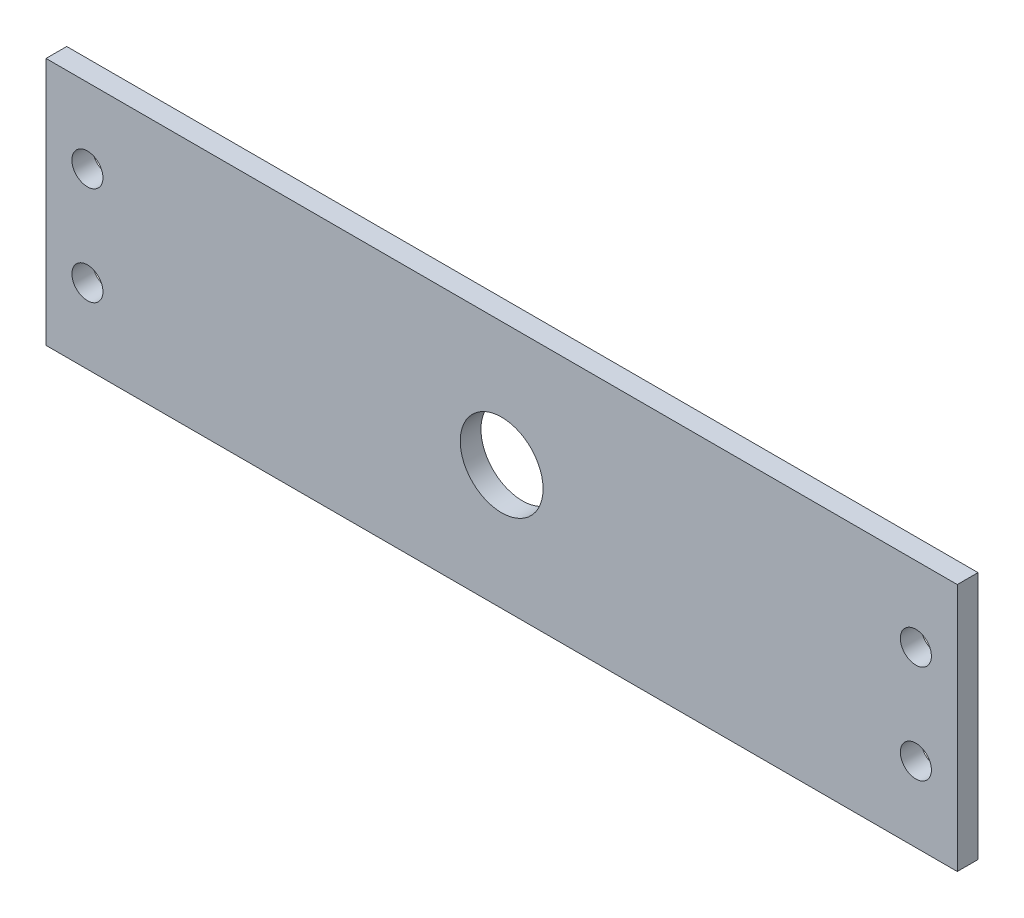
ISO-10303-21;
HEADER;
FILE_DESCRIPTION(('STEP AP214'),'2;1');
FILE_NAME('part.step','',(''),(''),'','','');
FILE_SCHEMA(('AUTOMOTIVE_DESIGN { 1 0 10303 214 1 1 1 1 }'));
ENDSEC;
DATA;
#1=APPLICATION_CONTEXT('core data for automotive mechanical design processes');
#2=APPLICATION_PROTOCOL_DEFINITION('international standard','automotive_design',2000,#1);
#3=PRODUCT_CONTEXT('',#1,'mechanical');
#4=PRODUCT('Part','Part','',(#3));
#5=PRODUCT_RELATED_PRODUCT_CATEGORY('part','',(#4));
#6=PRODUCT_DEFINITION_FORMATION('','',#4);
#7=PRODUCT_DEFINITION_CONTEXT('part definition',#1,'design');
#8=PRODUCT_DEFINITION('design','',#6,#7);
#9=PRODUCT_DEFINITION_SHAPE('','',#8);
#10=(LENGTH_UNIT() NAMED_UNIT(*) SI_UNIT(.MILLI.,.METRE.));
#11=(NAMED_UNIT(*) PLANE_ANGLE_UNIT() SI_UNIT($,.RADIAN.));
#12=(NAMED_UNIT(*) SI_UNIT($,.STERADIAN.) SOLID_ANGLE_UNIT());
#13=UNCERTAINTY_MEASURE_WITH_UNIT(LENGTH_MEASURE(1.E-05),#10,'distance_accuracy_value','');
#14=(GEOMETRIC_REPRESENTATION_CONTEXT(3) GLOBAL_UNCERTAINTY_ASSIGNED_CONTEXT((#13)) GLOBAL_UNIT_ASSIGNED_CONTEXT((#10,
#11,#12)) REPRESENTATION_CONTEXT('',''));
#15=CARTESIAN_POINT('',(0.,0.,0.));
#16=DIRECTION('',(0.,0.,1.));
#17=DIRECTION('',(1.,0.,0.));
#18=AXIS2_PLACEMENT_3D('',#15,#16,#17);
#19=CARTESIAN_POINT('',(0.,0.,12.7));
#20=DIRECTION('',(1.,0.,0.));
#21=DIRECTION('',(0.,0.,-1.));
#22=AXIS2_PLACEMENT_3D('',#19,#20,#21);
#23=PLANE('',#22);
#24=DIRECTION('',(0.,-1.,0.));
#25=VECTOR('',#24,1.);
#26=CARTESIAN_POINT('',(0.,0.,0.));
#27=LINE('',#26,#25);
#28=CARTESIAN_POINT('',(0.,152.4,0.));
#29=VERTEX_POINT('',#28);
#30=CARTESIAN_POINT('',(0.,0.,0.));
#31=VERTEX_POINT('',#30);
#32=EDGE_CURVE('E98',#29,#31,#27,.T.);
#33=ORIENTED_EDGE('',*,*,#32,.T.);
#34=DIRECTION('',(0.,0.,-1.));
#35=VECTOR('',#34,1.);
#36=CARTESIAN_POINT('',(0.,0.,12.7));
#37=LINE('',#36,#35);
#38=CARTESIAN_POINT('',(0.,0.,12.7));
#39=VERTEX_POINT('',#38);
#40=EDGE_CURVE('E11',#39,#31,#37,.T.);
#41=ORIENTED_EDGE('',*,*,#40,.F.);
#42=DIRECTION('',(0.,-1.,0.));
#43=VECTOR('',#42,1.);
#44=CARTESIAN_POINT('',(0.,0.,12.7));
#45=LINE('',#44,#43);
#46=CARTESIAN_POINT('',(0.,152.4,12.7));
#47=VERTEX_POINT('',#46);
#48=EDGE_CURVE('E86',#47,#39,#45,.T.);
#49=ORIENTED_EDGE('',*,*,#48,.F.);
#50=DIRECTION('',(0.,0.,-1.));
#51=VECTOR('',#50,1.);
#52=CARTESIAN_POINT('',(0.,152.4,12.7));
#53=LINE('',#52,#51);
#54=EDGE_CURVE('E94',#47,#29,#53,.T.);
#55=ORIENTED_EDGE('',*,*,#54,.T.);
#56=EDGE_LOOP('',(#33,#41,#49,#55));
#57=FACE_BOUND('',#56,.T.);
#58=ADVANCED_FACE('F35',(#57),#23,.F.);
#59=CARTESIAN_POINT('',(0.,0.,12.7));
#60=DIRECTION('',(0.,1.,0.));
#61=DIRECTION('',(0.,0.,1.));
#62=AXIS2_PLACEMENT_3D('',#59,#60,#61);
#63=PLANE('',#62);
#64=DIRECTION('',(1.,0.,0.));
#65=VECTOR('',#64,1.);
#66=CARTESIAN_POINT('',(0.,0.,0.));
#67=LINE('',#66,#65);
#68=CARTESIAN_POINT('',(558.8,0.,0.));
#69=VERTEX_POINT('',#68);
#70=EDGE_CURVE('E90',#31,#69,#67,.T.);
#71=ORIENTED_EDGE('',*,*,#70,.T.);
#72=DIRECTION('',(0.,0.,-1.));
#73=VECTOR('',#72,1.);
#74=CARTESIAN_POINT('',(558.8,0.,12.7));
#75=LINE('',#74,#73);
#76=CARTESIAN_POINT('',(558.8,0.,12.7));
#77=VERTEX_POINT('',#76);
#78=EDGE_CURVE('E43',#77,#69,#75,.T.);
#79=ORIENTED_EDGE('',*,*,#78,.F.);
#80=DIRECTION('',(1.,0.,0.));
#81=VECTOR('',#80,1.);
#82=CARTESIAN_POINT('',(0.,0.,12.7));
#83=LINE('',#82,#81);
#84=EDGE_CURVE('E81',#39,#77,#83,.T.);
#85=ORIENTED_EDGE('',*,*,#84,.F.);
#86=ORIENTED_EDGE('',*,*,#40,.T.);
#87=EDGE_LOOP('',(#71,#79,#85,#86));
#88=FACE_BOUND('',#87,.T.);
#89=ADVANCED_FACE('F89',(#88),#63,.F.);
#90=CARTESIAN_POINT('',(558.8,0.,12.7));
#91=DIRECTION('',(-1.,0.,0.));
#92=DIRECTION('',(0.,0.,1.));
#93=AXIS2_PLACEMENT_3D('',#90,#91,#92);
#94=PLANE('',#93);
#95=DIRECTION('',(0.,1.,0.));
#96=VECTOR('',#95,1.);
#97=CARTESIAN_POINT('',(558.8,0.,0.));
#98=LINE('',#97,#96);
#99=CARTESIAN_POINT('',(558.8,152.4,0.));
#100=VERTEX_POINT('',#99);
#101=EDGE_CURVE('E68',#69,#100,#98,.T.);
#102=ORIENTED_EDGE('',*,*,#101,.T.);
#103=DIRECTION('',(0.,0.,-1.));
#104=VECTOR('',#103,1.);
#105=CARTESIAN_POINT('',(558.8,152.4,12.7));
#106=LINE('',#105,#104);
#107=CARTESIAN_POINT('',(558.8,152.4,12.7));
#108=VERTEX_POINT('',#107);
#109=EDGE_CURVE('E91',#108,#100,#106,.T.);
#110=ORIENTED_EDGE('',*,*,#109,.F.);
#111=DIRECTION('',(0.,1.,0.));
#112=VECTOR('',#111,1.);
#113=CARTESIAN_POINT('',(558.8,0.,12.7));
#114=LINE('',#113,#112);
#115=EDGE_CURVE('E84',#77,#108,#114,.T.);
#116=ORIENTED_EDGE('',*,*,#115,.F.);
#117=ORIENTED_EDGE('',*,*,#78,.T.);
#118=EDGE_LOOP('',(#102,#110,#116,#117));
#119=FACE_BOUND('',#118,.T.);
#120=ADVANCED_FACE('F92',(#119),#94,.F.);
#121=CARTESIAN_POINT('',(0.,152.4,12.7));
#122=DIRECTION('',(0.,-1.,0.));
#123=DIRECTION('',(0.,0.,-1.));
#124=AXIS2_PLACEMENT_3D('',#121,#122,#123);
#125=PLANE('',#124);
#126=DIRECTION('',(-1.,0.,0.));
#127=VECTOR('',#126,1.);
#128=CARTESIAN_POINT('',(0.,152.4,0.));
#129=LINE('',#128,#127);
#130=EDGE_CURVE('E74',#100,#29,#129,.T.);
#131=ORIENTED_EDGE('',*,*,#130,.T.);
#132=ORIENTED_EDGE('',*,*,#54,.F.);
#133=DIRECTION('',(-1.,0.,0.));
#134=VECTOR('',#133,1.);
#135=CARTESIAN_POINT('',(0.,152.4,12.7));
#136=LINE('',#135,#134);
#137=EDGE_CURVE('E51',#108,#47,#136,.T.);
#138=ORIENTED_EDGE('',*,*,#137,.F.);
#139=ORIENTED_EDGE('',*,*,#109,.T.);
#140=EDGE_LOOP('',(#131,#132,#138,#139));
#141=FACE_BOUND('',#140,.T.);
#142=ADVANCED_FACE('F106',(#141),#125,.F.);
#143=CARTESIAN_POINT('',(0.,0.,12.7));
#144=DIRECTION('',(0.,0.,-1.));
#145=DIRECTION('',(-1.,0.,0.));
#146=AXIS2_PLACEMENT_3D('',#143,#144,#145);
#147=PLANE('',#146);
#148=CARTESIAN_POINT('',(279.4,76.2,12.7));
#149=DIRECTION('',(0.,0.,1.));
#150=DIRECTION('',(1.,0.,0.));
#151=AXIS2_PLACEMENT_3D('',#148,#149,#150);
#152=CIRCLE('',#151,25.4);
#153=CARTESIAN_POINT('',(304.8,76.2,12.7));
#154=VERTEX_POINT('',#153);
#155=EDGE_CURVE('E136',#154,#154,#152,.T.);
#156=ORIENTED_EDGE('',*,*,#155,.F.);
#157=EDGE_LOOP('',(#156));
#158=FACE_BOUND('',#157,.T.);
#159=CARTESIAN_POINT('',(25.4,106.426,12.7));
#160=DIRECTION('',(0.,0.,1.));
#161=DIRECTION('',(1.,0.,0.));
#162=AXIS2_PLACEMENT_3D('',#159,#160,#161);
#163=CIRCLE('',#162,9.52500000000007);
#164=CARTESIAN_POINT('',(34.925,106.426,12.7));
#165=VERTEX_POINT('',#164);
#166=EDGE_CURVE('E130',#165,#165,#163,.T.);
#167=ORIENTED_EDGE('',*,*,#166,.F.);
#168=EDGE_LOOP('',(#167));
#169=FACE_BOUND('',#168,.T.);
#170=CARTESIAN_POINT('',(25.4,45.9740000000002,12.7));
#171=DIRECTION('',(0.,0.,1.));
#172=DIRECTION('',(-1.,0.,0.));
#173=AXIS2_PLACEMENT_3D('',#170,#171,#172);
#174=CIRCLE('',#173,9.52500000000002);
#175=CARTESIAN_POINT('',(15.875,45.9740000000002,12.7));
#176=VERTEX_POINT('',#175);
#177=EDGE_CURVE('E124',#176,#176,#174,.T.);
#178=ORIENTED_EDGE('',*,*,#177,.F.);
#179=EDGE_LOOP('',(#178));
#180=FACE_BOUND('',#179,.T.);
#181=CARTESIAN_POINT('',(533.4,106.426,12.7));
#182=DIRECTION('',(0.,0.,1.));
#183=DIRECTION('',(-1.,0.,0.));
#184=AXIS2_PLACEMENT_3D('',#181,#182,#183);
#185=CIRCLE('',#184,9.52500000000014);
#186=CARTESIAN_POINT('',(523.875,106.426,12.7));
#187=VERTEX_POINT('',#186);
#188=EDGE_CURVE('E118',#187,#187,#185,.T.);
#189=ORIENTED_EDGE('',*,*,#188,.F.);
#190=EDGE_LOOP('',(#189));
#191=FACE_BOUND('',#190,.T.);
#192=CARTESIAN_POINT('',(533.4,45.9740000000001,12.7));
#193=DIRECTION('',(0.,0.,1.));
#194=DIRECTION('',(1.,0.,0.));
#195=AXIS2_PLACEMENT_3D('',#192,#193,#194);
#196=CIRCLE('',#195,9.52500000000002);
#197=CARTESIAN_POINT('',(542.925,45.9740000000001,12.7));
#198=VERTEX_POINT('',#197);
#199=EDGE_CURVE('E112',#198,#198,#196,.T.);
#200=ORIENTED_EDGE('',*,*,#199,.F.);
#201=EDGE_LOOP('',(#200));
#202=FACE_BOUND('',#201,.T.);
#203=ORIENTED_EDGE('',*,*,#48,.T.);
#204=ORIENTED_EDGE('',*,*,#84,.T.);
#205=ORIENTED_EDGE('',*,*,#115,.T.);
#206=ORIENTED_EDGE('',*,*,#137,.T.);
#207=EDGE_LOOP('',(#203,#204,#205,#206));
#208=FACE_BOUND('',#207,.T.);
#209=ADVANCED_FACE('F82',(#158,#169,#180,#191,#202,#208),#147,.F.);
#210=CARTESIAN_POINT('',(0.,0.,0.));
#211=DIRECTION('',(0.,0.,-1.));
#212=DIRECTION('',(-1.,0.,0.));
#213=AXIS2_PLACEMENT_3D('',#210,#211,#212);
#214=PLANE('',#213);
#215=CARTESIAN_POINT('',(279.4,76.2,0.));
#216=DIRECTION('',(0.,0.,1.));
#217=DIRECTION('',(1.,0.,0.));
#218=AXIS2_PLACEMENT_3D('',#215,#216,#217);
#219=CIRCLE('',#218,25.4);
#220=CARTESIAN_POINT('',(304.8,76.2,0.));
#221=VERTEX_POINT('',#220);
#222=EDGE_CURVE('E133',#221,#221,#219,.T.);
#223=ORIENTED_EDGE('',*,*,#222,.T.);
#224=EDGE_LOOP('',(#223));
#225=FACE_BOUND('',#224,.T.);
#226=CARTESIAN_POINT('',(25.4,106.426,0.));
#227=DIRECTION('',(0.,0.,1.));
#228=DIRECTION('',(1.,0.,0.));
#229=AXIS2_PLACEMENT_3D('',#226,#227,#228);
#230=CIRCLE('',#229,9.52500000000007);
#231=CARTESIAN_POINT('',(34.925,106.426,0.));
#232=VERTEX_POINT('',#231);
#233=EDGE_CURVE('E127',#232,#232,#230,.T.);
#234=ORIENTED_EDGE('',*,*,#233,.T.);
#235=EDGE_LOOP('',(#234));
#236=FACE_BOUND('',#235,.T.);
#237=CARTESIAN_POINT('',(25.4,45.9740000000002,0.));
#238=DIRECTION('',(0.,0.,1.));
#239=DIRECTION('',(-1.,0.,0.));
#240=AXIS2_PLACEMENT_3D('',#237,#238,#239);
#241=CIRCLE('',#240,9.52500000000002);
#242=CARTESIAN_POINT('',(15.875,45.9740000000002,0.));
#243=VERTEX_POINT('',#242);
#244=EDGE_CURVE('E121',#243,#243,#241,.T.);
#245=ORIENTED_EDGE('',*,*,#244,.T.);
#246=EDGE_LOOP('',(#245));
#247=FACE_BOUND('',#246,.T.);
#248=CARTESIAN_POINT('',(533.4,106.426,0.));
#249=DIRECTION('',(0.,0.,1.));
#250=DIRECTION('',(-1.,0.,0.));
#251=AXIS2_PLACEMENT_3D('',#248,#249,#250);
#252=CIRCLE('',#251,9.52500000000014);
#253=CARTESIAN_POINT('',(523.875,106.426,0.));
#254=VERTEX_POINT('',#253);
#255=EDGE_CURVE('E115',#254,#254,#252,.T.);
#256=ORIENTED_EDGE('',*,*,#255,.T.);
#257=EDGE_LOOP('',(#256));
#258=FACE_BOUND('',#257,.T.);
#259=CARTESIAN_POINT('',(533.4,45.9740000000001,0.));
#260=DIRECTION('',(0.,0.,1.));
#261=DIRECTION('',(1.,0.,0.));
#262=AXIS2_PLACEMENT_3D('',#259,#260,#261);
#263=CIRCLE('',#262,9.52500000000002);
#264=CARTESIAN_POINT('',(542.925,45.9740000000001,0.));
#265=VERTEX_POINT('',#264);
#266=EDGE_CURVE('E101',#265,#265,#263,.T.);
#267=ORIENTED_EDGE('',*,*,#266,.T.);
#268=EDGE_LOOP('',(#267));
#269=FACE_BOUND('',#268,.T.);
#270=ORIENTED_EDGE('',*,*,#32,.F.);
#271=ORIENTED_EDGE('',*,*,#130,.F.);
#272=ORIENTED_EDGE('',*,*,#101,.F.);
#273=ORIENTED_EDGE('',*,*,#70,.F.);
#274=EDGE_LOOP('',(#270,#271,#272,#273));
#275=FACE_BOUND('',#274,.T.);
#276=ADVANCED_FACE('F109',(#225,#236,#247,#258,#269,#275),#214,.T.);
#277=CARTESIAN_POINT('',(533.4,45.9740000000001,0.));
#278=DIRECTION('',(0.,0.,1.));
#279=DIRECTION('',(1.,0.,0.));
#280=AXIS2_PLACEMENT_3D('',#277,#278,#279);
#281=CYLINDRICAL_SURFACE('',#280,9.52500000000002);
#282=ORIENTED_EDGE('',*,*,#266,.F.);
#283=EDGE_LOOP('',(#282));
#284=FACE_BOUND('',#283,.T.);
#285=ORIENTED_EDGE('',*,*,#199,.T.);
#286=EDGE_LOOP('',(#285));
#287=FACE_BOUND('',#286,.T.);
#288=ADVANCED_FACE('F162',(#284,#287),#281,.F.);
#289=CARTESIAN_POINT('',(533.4,106.426,0.));
#290=DIRECTION('',(0.,0.,1.));
#291=DIRECTION('',(1.,0.,0.));
#292=AXIS2_PLACEMENT_3D('',#289,#290,#291);
#293=CYLINDRICAL_SURFACE('',#292,9.52500000000014);
#294=ORIENTED_EDGE('',*,*,#255,.F.);
#295=EDGE_LOOP('',(#294));
#296=FACE_BOUND('',#295,.T.);
#297=ORIENTED_EDGE('',*,*,#188,.T.);
#298=EDGE_LOOP('',(#297));
#299=FACE_BOUND('',#298,.T.);
#300=ADVANCED_FACE('F164',(#296,#299),#293,.F.);
#301=CARTESIAN_POINT('',(25.4,45.9740000000002,0.));
#302=DIRECTION('',(0.,0.,1.));
#303=DIRECTION('',(1.,0.,0.));
#304=AXIS2_PLACEMENT_3D('',#301,#302,#303);
#305=CYLINDRICAL_SURFACE('',#304,9.52500000000002);
#306=ORIENTED_EDGE('',*,*,#244,.F.);
#307=EDGE_LOOP('',(#306));
#308=FACE_BOUND('',#307,.T.);
#309=ORIENTED_EDGE('',*,*,#177,.T.);
#310=EDGE_LOOP('',(#309));
#311=FACE_BOUND('',#310,.T.);
#312=ADVANCED_FACE('F171',(#308,#311),#305,.F.);
#313=CARTESIAN_POINT('',(25.4,106.426,0.));
#314=DIRECTION('',(0.,0.,1.));
#315=DIRECTION('',(1.,0.,0.));
#316=AXIS2_PLACEMENT_3D('',#313,#314,#315);
#317=CYLINDRICAL_SURFACE('',#316,9.52500000000007);
#318=ORIENTED_EDGE('',*,*,#233,.F.);
#319=EDGE_LOOP('',(#318));
#320=FACE_BOUND('',#319,.T.);
#321=ORIENTED_EDGE('',*,*,#166,.T.);
#322=EDGE_LOOP('',(#321));
#323=FACE_BOUND('',#322,.T.);
#324=ADVANCED_FACE('F147',(#320,#323),#317,.F.);
#325=CARTESIAN_POINT('',(279.4,76.2,0.));
#326=DIRECTION('',(0.,0.,1.));
#327=DIRECTION('',(1.,0.,0.));
#328=AXIS2_PLACEMENT_3D('',#325,#326,#327);
#329=CYLINDRICAL_SURFACE('',#328,25.4);
#330=ORIENTED_EDGE('',*,*,#222,.F.);
#331=EDGE_LOOP('',(#330));
#332=FACE_BOUND('',#331,.T.);
#333=ORIENTED_EDGE('',*,*,#155,.T.);
#334=EDGE_LOOP('',(#333));
#335=FACE_BOUND('',#334,.T.);
#336=ADVANCED_FACE('F144',(#332,#335),#329,.F.);
#337=CLOSED_SHELL('',(#58,#89,#120,#142,#209,#276,#288,#300,#312,#324,#336));
#338=MANIFOLD_SOLID_BREP('B2',#337);
#339=ADVANCED_BREP_SHAPE_REPRESENTATION('',(#18,#338),#14);
#340=SHAPE_DEFINITION_REPRESENTATION(#9,#339);
ENDSEC;
END-ISO-10303-21;
